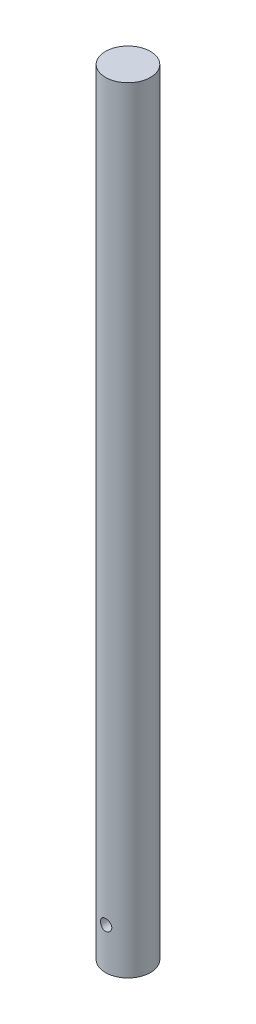
ISO-10303-21;
HEADER;
FILE_DESCRIPTION(('STEP AP214'),'2;1');
FILE_NAME('part.step','',(''),(''),'','','');
FILE_SCHEMA(('AUTOMOTIVE_DESIGN { 1 0 10303 214 1 1 1 1 }'));
ENDSEC;
DATA;
#1=APPLICATION_CONTEXT('core data for automotive mechanical design processes');
#2=APPLICATION_PROTOCOL_DEFINITION('international standard','automotive_design',2000,#1);
#3=PRODUCT_CONTEXT('',#1,'mechanical');
#4=PRODUCT('Part','Part','',(#3));
#5=PRODUCT_RELATED_PRODUCT_CATEGORY('part','',(#4));
#6=PRODUCT_DEFINITION_FORMATION('','',#4);
#7=PRODUCT_DEFINITION_CONTEXT('part definition',#1,'design');
#8=PRODUCT_DEFINITION('design','',#6,#7);
#9=PRODUCT_DEFINITION_SHAPE('','',#8);
#10=(LENGTH_UNIT() NAMED_UNIT(*) SI_UNIT(.MILLI.,.METRE.));
#11=(NAMED_UNIT(*) PLANE_ANGLE_UNIT() SI_UNIT($,.RADIAN.));
#12=(NAMED_UNIT(*) SI_UNIT($,.STERADIAN.) SOLID_ANGLE_UNIT());
#13=UNCERTAINTY_MEASURE_WITH_UNIT(LENGTH_MEASURE(1.E-05),#10,'distance_accuracy_value','');
#14=(GEOMETRIC_REPRESENTATION_CONTEXT(3) GLOBAL_UNCERTAINTY_ASSIGNED_CONTEXT((#13)) GLOBAL_UNIT_ASSIGNED_CONTEXT((#10,
#11,#12)) REPRESENTATION_CONTEXT('',''));
#15=CARTESIAN_POINT('',(0.,0.,0.));
#16=DIRECTION('',(0.,0.,1.));
#17=DIRECTION('',(1.,0.,0.));
#18=AXIS2_PLACEMENT_3D('',#15,#16,#17);
#19=CARTESIAN_POINT('',(0.,656.12,0.));
#20=DIRECTION('',(0.,-1.,0.));
#21=DIRECTION('',(0.,0.,-1.));
#22=AXIS2_PLACEMENT_3D('',#19,#20,#21);
#23=CYLINDRICAL_SURFACE('',#22,19.05);
#24=CARTESIAN_POINT('',(0.,39.7649999999999,-19.05));
#25=CARTESIAN_POINT('',(-0.263265211254861,39.7649926201443,-19.0499955515464));
#26=CARTESIAN_POINT('',(-0.526612834496202,39.7431085899166,-19.0444882667373));
#27=CARTESIAN_POINT('',(-1.04576024353247,39.6562819744417,-19.0230522770523));
#28=CARTESIAN_POINT('',(-1.30155567066714,39.5913150128909,-19.0071176724709));
#29=CARTESIAN_POINT('',(-1.79802679301537,39.4205376630109,-18.9665915031212));
#30=CARTESIAN_POINT('',(-2.03872025261759,39.3147763494138,-18.9420103430908));
#31=CARTESIAN_POINT('',(-2.49894882407979,39.0655851793179,-18.886808821123));
#32=CARTESIAN_POINT('',(-2.71848321646828,38.9221540425498,-18.8561882539356));
#33=CARTESIAN_POINT('',(-3.13468790260626,38.5985713933085,-18.7915262162897));
#34=CARTESIAN_POINT('',(-3.3308598616217,38.4177894270096,-18.7574319232655));
#35=CARTESIAN_POINT('',(-3.69043987258169,38.0259866433497,-18.6900159213816));
#36=CARTESIAN_POINT('',(-3.85384422121504,37.8149624127015,-18.6566943002231));
#37=CARTESIAN_POINT('',(-4.14559497506888,37.3647950761234,-18.5940638080124));
#38=CARTESIAN_POINT('',(-4.27338379918449,37.1252804280186,-18.5648219918294));
#39=CARTESIAN_POINT('',(-4.48669026961244,36.6273189802452,-18.5144323480421));
#40=CARTESIAN_POINT('',(-4.57221468179623,36.3688752184427,-18.4932832250464));
#41=CARTESIAN_POINT('',(-4.69686433359865,35.8458717116178,-18.4620164523183));
#42=CARTESIAN_POINT('',(-4.73688563940206,35.5815385422511,-18.4516860894675));
#43=CARTESIAN_POINT('',(-4.77218413773463,35.0497236704873,-18.4425897804384));
#44=CARTESIAN_POINT('',(-4.7674686178113,34.7822424879856,-18.4438219507441));
#45=CARTESIAN_POINT('',(-4.714142227105,34.2585930913579,-18.4575202823196));
#46=CARTESIAN_POINT('',(-4.66659926459899,34.0023078587809,-18.4697131224584));
#47=CARTESIAN_POINT('',(-4.53067116110665,33.5014716544506,-18.5035233716592));
#48=CARTESIAN_POINT('',(-4.44228310778031,33.2569215208071,-18.5251414527542));
#49=CARTESIAN_POINT('',(-4.22626405623031,32.7836344369153,-18.5756171646484));
#50=CARTESIAN_POINT('',(-4.09824558451354,32.5550822218513,-18.6045457343777));
#51=CARTESIAN_POINT('',(-3.80687066061067,32.1223209345215,-18.6663428672246));
#52=CARTESIAN_POINT('',(-3.64350801875435,31.9181161358406,-18.6992121200066));
#53=CARTESIAN_POINT('',(-3.28055094507249,31.5337267146407,-18.7663377909751));
#54=CARTESIAN_POINT('',(-3.08005537492094,31.3543941542299,-18.8006070231433));
#55=CARTESIAN_POINT('',(-2.65142565171568,31.0317352636455,-18.8658253171989));
#56=CARTESIAN_POINT('',(-2.42329065299133,30.8884100355838,-18.8967742774429));
#57=CARTESIAN_POINT('',(-1.9446414216666,30.6415208904162,-18.9520192245389));
#58=CARTESIAN_POINT('',(-1.69405287727385,30.5380955009202,-18.9762919500538));
#59=CARTESIAN_POINT('',(-1.17830380293656,30.375075177787,-19.0152803673754));
#60=CARTESIAN_POINT('',(-0.913146073888306,30.3154718509132,-19.0299978892262));
#61=CARTESIAN_POINT('',(-0.383070389815681,30.2430891379215,-19.0479467753632));
#62=CARTESIAN_POINT('',(-0.118320282238053,30.2291494253203,-19.0514627104745));
#63=CARTESIAN_POINT('',(0.409730011595878,30.2453070011169,-19.0474228424188));
#64=CARTESIAN_POINT('',(0.673030326369689,30.2754003209885,-19.0398680370146));
#65=CARTESIAN_POINT('',(1.18667400021565,30.3778133595807,-19.0147179247928));
#66=CARTESIAN_POINT('',(1.43715163707315,30.4494999618604,-18.9972732469182));
#67=CARTESIAN_POINT('',(1.92251297115364,30.6323413871547,-18.9543097733156));
#68=CARTESIAN_POINT('',(2.15739508973179,30.743500198507,-18.9287901617114));
#69=CARTESIAN_POINT('',(2.60951359661001,31.0043786902547,-18.871826229655));
#70=CARTESIAN_POINT('',(2.82636253382391,31.1547481195563,-18.8402847401568));
#71=CARTESIAN_POINT('',(3.23216102113291,31.4889489814393,-18.7749288358825));
#72=CARTESIAN_POINT('',(3.42110574075642,31.6727861953268,-18.7411140290455));
#73=CARTESIAN_POINT('',(3.77051471095466,32.0740916876299,-18.673998119737));
#74=CARTESIAN_POINT('',(3.93016499899015,32.2922753890457,-18.6407300602087));
#75=CARTESIAN_POINT('',(4.21058541470607,32.7530215216539,-18.5794013573027));
#76=CARTESIAN_POINT('',(4.33135726781044,32.9955828703397,-18.5513404828537));
#77=CARTESIAN_POINT('',(4.5296934048956,33.4968989453242,-18.5039125929347));
#78=CARTESIAN_POINT('',(4.6075136689512,33.7555472837371,-18.4844942078739));
#79=CARTESIAN_POINT('',(4.71841159828718,34.2828161737733,-18.4565008772953));
#80=CARTESIAN_POINT('',(4.75149906088235,34.5514345285313,-18.4479235574097));
#81=CARTESIAN_POINT('',(4.7714798446142,35.0827350210916,-18.4427646152436));
#82=CARTESIAN_POINT('',(4.75967418884681,35.3453657329154,-18.4458451309353));
#83=CARTESIAN_POINT('',(4.69318177062745,35.8647640987475,-18.4628735437947));
#84=CARTESIAN_POINT('',(4.63849587168855,36.1215318707154,-18.4768212221219));
#85=CARTESIAN_POINT('',(4.48850620730765,36.6204993539159,-18.5138240010824));
#86=CARTESIAN_POINT('',(4.39344670349074,36.8627768359544,-18.5368242728665));
#87=CARTESIAN_POINT('',(4.16560150003315,37.3281173235597,-18.5893483537122));
#88=CARTESIAN_POINT('',(4.03281056243546,37.5511776557546,-18.618873068384));
#89=CARTESIAN_POINT('',(3.72919412213601,37.978038269465,-18.6820826268311));
#90=CARTESIAN_POINT('',(3.55746599960887,38.1811835388942,-18.7158559691186));
#91=CARTESIAN_POINT('',(3.18260855149612,38.5561968905607,-18.7832292865691));
#92=CARTESIAN_POINT('',(2.97947177857616,38.7280575337736,-18.8168292186571));
#93=CARTESIAN_POINT('',(2.54311718061298,39.0386621239189,-18.8807970293255));
#94=CARTESIAN_POINT('',(2.30942064553616,39.17674898282,-18.9110952448362));
#95=CARTESIAN_POINT('',(1.82139399193016,39.4114563338567,-18.9643106376113));
#96=CARTESIAN_POINT('',(1.56707880237168,39.5081065150249,-18.9872330965958));
#97=CARTESIAN_POINT('',(1.09435178682454,39.6428642884318,-19.0197288497069));
#98=CARTESIAN_POINT('',(0.878190056555769,39.6885661191225,-19.0310025178053));
#99=CARTESIAN_POINT('',(0.441371299102453,39.7496359252228,-19.0461396784107));
#100=CARTESIAN_POINT('',(0.220714612022166,39.7650061870763,-19.0500037294662));
#101=CARTESIAN_POINT('',(0.,39.7649999999999,-19.05));
#102=B_SPLINE_CURVE_WITH_KNOTS('',3,(#24,#25,#26,#27,#28,#29,#30,#31,#32,#33,#34,#35,#36,#37,
#38,#39,#40,#41,#42,#43,#44,#45,#46,#47,#48,#49,#50,#51,#52,#53,#54,#55,#56,#57,#58,#59,#60,#61,
#62,#63,#64,#65,#66,#67,#68,#69,#70,#71,#72,#73,#74,#75,#76,#77,#78,#79,#80,#81,#82,#83,#84,#85,
#86,#87,#88,#89,#90,#91,#92,#93,#94,#95,#96,#97,#98,#99,#100,#101),.UNSPECIFIED.,.T.,.F.,(4,2,2,
2,2,2,2,2,2,2,2,2,2,2,2,2,2,2,2,2,2,2,2,2,2,2,2,2,2,2,2,2,2,2,2,2,2,2,4),(0.,0.788986790709131,
1.57842037111025,2.3669072268128,3.15542088397193,3.9585274703752,4.7617247707322,
5.576868392127,6.3918814794691,7.19055082686614,7.98909007471391,8.76825256617257,
9.54747062211301,10.3345616140847,11.1217905575998,11.9314913183108,12.7412168593157,
13.553728902364,14.3660852844672,15.1576324402231,15.9491082612996,16.7288413462057,
17.5086532390678,18.3023138998786,19.0961117898661,19.9094161177029,20.7226843461374,
21.5310518823164,22.3392423422857,23.1241920278442,23.9091259066617,24.6893770793648,
25.4697366211415,26.2704729859313,27.0713995060535,27.8868507374527,28.7017167244677,
29.3632323158842,30.0246980392585),.UNSPECIFIED.);
#103=CARTESIAN_POINT('',(0.,39.7649999999999,-19.05));
#104=VERTEX_POINT('',#103);
#105=EDGE_CURVE('E10',#104,#104,#102,.T.);
#106=ORIENTED_EDGE('',*,*,#105,.T.);
#107=EDGE_LOOP('',(#106));
#108=FACE_BOUND('',#107,.T.);
#109=CARTESIAN_POINT('',(4.765,35.,18.4444375083655));
#110=CARTESIAN_POINT('',(4.76499253394754,34.7368800682417,18.4444425285765));
#111=CARTESIAN_POINT('',(4.74313182145982,34.4736775414527,18.4501293147716));
#112=CARTESIAN_POINT('',(4.65640620518506,33.9548311388066,18.4722038293386));
#113=CARTESIAN_POINT('',(4.59151629989312,33.6991917476636,18.4885977788731));
#114=CARTESIAN_POINT('',(4.42096412981292,33.203051545091,18.530116362269));
#115=CARTESIAN_POINT('',(4.31535453523024,32.9625316423709,18.5552297135784));
#116=CARTESIAN_POINT('',(4.06652128468699,32.5025970538563,18.6113434099178));
#117=CARTESIAN_POINT('',(3.92329602150704,32.2831832704187,18.6423440064788));
#118=CARTESIAN_POINT('',(3.59992696396594,31.8668558265112,18.7075036989851));
#119=CARTESIAN_POINT('',(3.41910636519058,31.6704756527764,18.7417133012387));
#120=CARTESIAN_POINT('',(3.02713722515421,31.3104899709358,18.8089983242118));
#121=CARTESIAN_POINT('',(2.8159858494358,31.1468875293849,18.8420736385722));
#122=CARTESIAN_POINT('',(2.36569387066518,30.8549183887762,18.9039222142229));
#123=CARTESIAN_POINT('',(2.12620348877929,30.7270758218725,18.9326289260712));
#124=CARTESIAN_POINT('',(1.62829403021747,30.5136634565593,18.9819296026007));
#125=CARTESIAN_POINT('',(1.36987775584669,30.4280874143335,19.0025247654682));
#126=CARTESIAN_POINT('',(0.847013638180592,30.3033461979092,19.0329247816015));
#127=CARTESIAN_POINT('',(0.582794371964287,30.2632750697392,19.0429399774285));
#128=CARTESIAN_POINT('',(0.0512066238273121,30.2278373642091,19.0517846278309));
#129=CARTESIAN_POINT('',(-0.216161386171357,30.2324641707522,19.050615737852));
#130=CARTESIAN_POINT('',(-0.740173529842505,30.2856395241096,19.0373804769759));
#131=CARTESIAN_POINT('',(-0.996923949372722,30.3332101701498,19.0255567446553));
#132=CARTESIAN_POINT('',(-1.49867570045084,30.4693509260457,18.992622885621));
#133=CARTESIAN_POINT('',(-1.74367640543008,30.5579232196901,18.9715122642813));
#134=CARTESIAN_POINT('',(-2.21754980129284,30.7743439378524,18.9220055530041));
#135=CARTESIAN_POINT('',(-2.44625661871718,30.9025402799463,18.8935453093686));
#136=CARTESIAN_POINT('',(-2.87925396839516,31.1943061092839,18.8324263417817));
#137=CARTESIAN_POINT('',(-3.08354023915232,31.3578817564267,18.7997668871067));
#138=CARTESIAN_POINT('',(-3.46772955999338,31.7210046516961,18.7327642600676));
#139=CARTESIAN_POINT('',(-3.64682206057596,31.9214063955037,18.6983994437385));
#140=CARTESIAN_POINT('',(-3.9690393750814,32.3497582435379,18.632668778602));
#141=CARTESIAN_POINT('',(-4.11216250427889,32.5777096373886,18.6013030703088));
#142=CARTESIAN_POINT('',(-4.35889808415529,33.0562814277221,18.5450444436967));
#143=CARTESIAN_POINT('',(-4.46231519945757,33.3070065779162,18.5201837128751));
#144=CARTESIAN_POINT('',(-4.62527858668665,33.8230562811482,18.4801627604254));
#145=CARTESIAN_POINT('',(-4.68483425787014,34.088377693186,18.4650004605706));
#146=CARTESIAN_POINT('',(-4.75703893537006,34.6185710466149,18.4465293229528));
#147=CARTESIAN_POINT('',(-4.77088646820728,34.883269408923,18.442917692324));
#148=CARTESIAN_POINT('',(-4.75456315449023,35.4111953389613,18.4471325852967));
#149=CARTESIAN_POINT('',(-4.72439636472193,35.6744230399971,18.4549580547444));
#150=CARTESIAN_POINT('',(-4.62195164618801,36.1874837084709,18.4808752454782));
#151=CARTESIAN_POINT('',(-4.55037170986197,36.4374654695674,18.4987966771173));
#152=CARTESIAN_POINT('',(-4.36790657666418,36.9218815516558,18.5427247883424));
#153=CARTESIAN_POINT('',(-4.25701671996745,37.1563140255117,18.5687324264277));
#154=CARTESIAN_POINT('',(-3.99657145809519,37.6080545605138,18.6265399386717));
#155=CARTESIAN_POINT('',(-3.84629958783916,37.8249359879117,18.6584435191855));
#156=CARTESIAN_POINT('',(-3.51226176217661,38.2308442974882,18.7241938256162));
#157=CARTESIAN_POINT('',(-3.32849029641699,38.4198665878488,18.7580408705853));
#158=CARTESIAN_POINT('',(-2.92716913307842,38.7695469875133,18.824890712737));
#159=CARTESIAN_POINT('',(-2.7088885966265,38.9293759448455,18.8578511212472));
#160=CARTESIAN_POINT('',(-2.24789098441662,39.2101102911897,18.91833630164));
#161=CARTESIAN_POINT('',(-2.00517518449517,39.3310177110268,18.9458613570961));
#162=CARTESIAN_POINT('',(-1.50387454132547,39.5294266437364,18.9922009859132));
#163=CARTESIAN_POINT('',(-1.24541934639061,39.6072404413959,19.0110780510668));
#164=CARTESIAN_POINT('',(-0.718566131278481,39.7181904363559,19.0382683438607));
#165=CARTESIAN_POINT('',(-0.450170042410263,39.7513352656122,19.046583612474));
#166=CARTESIAN_POINT('',(0.0811569645299841,39.7715204854658,19.0516300031007));
#167=CARTESIAN_POINT('',(0.344039181675942,39.7597844714264,19.0486685735105));
#168=CARTESIAN_POINT('',(0.863959572964795,39.6933440588025,19.0321762045503));
#169=CARTESIAN_POINT('',(1.12099792100997,39.6386409405629,19.018645580124));
#170=CARTESIAN_POINT('',(1.62065205147047,39.4884756479592,18.9825827762077));
#171=CARTESIAN_POINT('',(1.86333815295651,39.3932349278606,18.9600995466223));
#172=CARTESIAN_POINT('',(2.32942291858038,39.1648988992488,18.9084989834101));
#173=CARTESIAN_POINT('',(2.55281914450256,39.0317988144638,18.8793808128229));
#174=CARTESIAN_POINT('',(2.97978360927441,38.7277917235328,18.8167772861324));
#175=CARTESIAN_POINT('',(3.18274795985904,38.5560546954655,18.7832039537837));
#176=CARTESIAN_POINT('',(3.55739239819722,38.1812599001923,18.7158694747159));
#177=CARTESIAN_POINT('',(3.72906453995354,37.9781942018333,18.6821082825303));
#178=CARTESIAN_POINT('',(4.03940000761457,37.5419401312552,18.6175025683245));
#179=CARTESIAN_POINT('',(4.17738679555632,37.3082599088033,18.5867243135507));
#180=CARTESIAN_POINT('',(4.41191121503434,36.8202821848046,18.5324615547298));
#181=CARTESIAN_POINT('',(4.50847898039923,36.5659998327291,18.508971751525));
#182=CARTESIAN_POINT('',(4.64306152350317,36.0934741980493,18.4756133752866));
#183=CARTESIAN_POINT('',(4.68868870992553,35.8774902162995,18.4640104602906));
#184=CARTESIAN_POINT('',(4.7496597825117,35.4410232408862,18.4484207485055));
#185=CARTESIAN_POINT('',(4.76500625786092,35.2205406335116,18.4444333005485));
#186=CARTESIAN_POINT('',(4.765,35.,18.4444375083655));
#187=B_SPLINE_CURVE_WITH_KNOTS('',3,(#109,#110,#111,#112,#113,#114,#115,#116,#117,#118,#119,
#120,#121,#122,#123,#124,#125,#126,#127,#128,#129,#130,#131,#132,#133,#134,#135,#136,#137,#138,
#139,#140,#141,#142,#143,#144,#145,#146,#147,#148,#149,#150,#151,#152,#153,#154,#155,#156,#157,
#158,#159,#160,#161,#162,#163,#164,#165,#166,#167,#168,#169,#170,#171,#172,#173,#174,#175,#176,
#177,#178,#179,#180,#181,#182,#183,#184,#185,#186),.UNSPECIFIED.,.T.,.F.,(4,2,2,2,2,2,2,2,2,2,2,
2,2,2,2,2,2,2,2,2,2,2,2,2,2,2,2,2,2,2,2,2,2,2,2,2,2,2,4),(0.,0.788549891288953,1.57755836029501,
2.36554966597998,3.15357464595634,3.95725215471351,4.76100481728093,5.57598509752506,
6.39084494888722,7.18918063523405,7.98739815537878,8.76788515535759,9.54841372963673,
10.3360003461753,11.1237242001489,11.9327894681019,12.7418926238134,13.5549266948541,
14.367786486606,15.1591552295999,15.9504510369987,16.728783250779,17.5072077594643,
18.3009170589978,19.0947570338868,19.9084830626429,20.7221666263988,21.5298738556445,
22.3374249789063,23.123118677802,23.9087889652831,24.6902211892096,25.4717520410271,
26.2720227559753,27.0724964005801,27.8879234937639,28.7027563239446,29.3637559048891,
30.0246989638898),.UNSPECIFIED.);
#188=CARTESIAN_POINT('',(4.765,35.,18.4444375083655));
#189=VERTEX_POINT('',#188);
#190=EDGE_CURVE('E48',#189,#189,#187,.T.);
#191=ORIENTED_EDGE('',*,*,#190,.T.);
#192=EDGE_LOOP('',(#191));
#193=FACE_BOUND('',#192,.T.);
#194=CARTESIAN_POINT('',(0.,656.12,0.));
#195=DIRECTION('',(0.,1.,0.));
#196=DIRECTION('',(0.,0.,1.));
#197=AXIS2_PLACEMENT_3D('',#194,#195,#196);
#198=CIRCLE('',#197,19.05);
#199=CARTESIAN_POINT('',(0.,656.12,19.05));
#200=VERTEX_POINT('',#199);
#201=EDGE_CURVE('E52',#200,#200,#198,.T.);
#202=ORIENTED_EDGE('',*,*,#201,.F.);
#203=EDGE_LOOP('',(#202));
#204=FACE_BOUND('',#203,.T.);
#205=CARTESIAN_POINT('',(0.,0.,0.));
#206=DIRECTION('',(0.,1.,0.));
#207=DIRECTION('',(0.,0.,1.));
#208=AXIS2_PLACEMENT_3D('',#205,#206,#207);
#209=CIRCLE('',#208,19.05);
#210=CARTESIAN_POINT('',(0.,0.,19.05));
#211=VERTEX_POINT('',#210);
#212=EDGE_CURVE('E56',#211,#211,#209,.T.);
#213=ORIENTED_EDGE('',*,*,#212,.T.);
#214=EDGE_LOOP('',(#213));
#215=FACE_BOUND('',#214,.T.);
#216=ADVANCED_FACE('F37',(#108,#193,#204,#215),#23,.T.);
#217=CARTESIAN_POINT('',(0.,656.12,0.));
#218=DIRECTION('',(0.,1.,0.));
#219=DIRECTION('',(0.,0.,1.));
#220=AXIS2_PLACEMENT_3D('',#217,#218,#219);
#221=PLANE('',#220);
#222=ORIENTED_EDGE('',*,*,#201,.T.);
#223=EDGE_LOOP('',(#222));
#224=FACE_BOUND('',#223,.T.);
#225=ADVANCED_FACE('F68',(#224),#221,.T.);
#226=CARTESIAN_POINT('',(0.,0.,0.));
#227=DIRECTION('',(0.,1.,0.));
#228=DIRECTION('',(0.,0.,1.));
#229=AXIS2_PLACEMENT_3D('',#226,#227,#228);
#230=PLANE('',#229);
#231=ORIENTED_EDGE('',*,*,#212,.F.);
#232=EDGE_LOOP('',(#231));
#233=FACE_BOUND('',#232,.T.);
#234=ADVANCED_FACE('F66',(#233),#230,.F.);
#235=CARTESIAN_POINT('',(0.,35.,-19.05));
#236=DIRECTION('',(0.,0.,1.));
#237=DIRECTION('',(1.,0.,0.));
#238=AXIS2_PLACEMENT_3D('',#235,#236,#237);
#239=CYLINDRICAL_SURFACE('',#238,4.765);
#240=ORIENTED_EDGE('',*,*,#190,.F.);
#241=EDGE_LOOP('',(#240));
#242=FACE_BOUND('',#241,.T.);
#243=ORIENTED_EDGE('',*,*,#105,.F.);
#244=EDGE_LOOP('',(#243));
#245=FACE_BOUND('',#244,.T.);
#246=ADVANCED_FACE('F62',(#242,#245),#239,.F.);
#247=CLOSED_SHELL('',(#216,#225,#234,#246));
#248=MANIFOLD_SOLID_BREP('B2',#247);
#249=ADVANCED_BREP_SHAPE_REPRESENTATION('',(#18,#248),#14);
#250=SHAPE_DEFINITION_REPRESENTATION(#9,#249);
ENDSEC;
END-ISO-10303-21;
